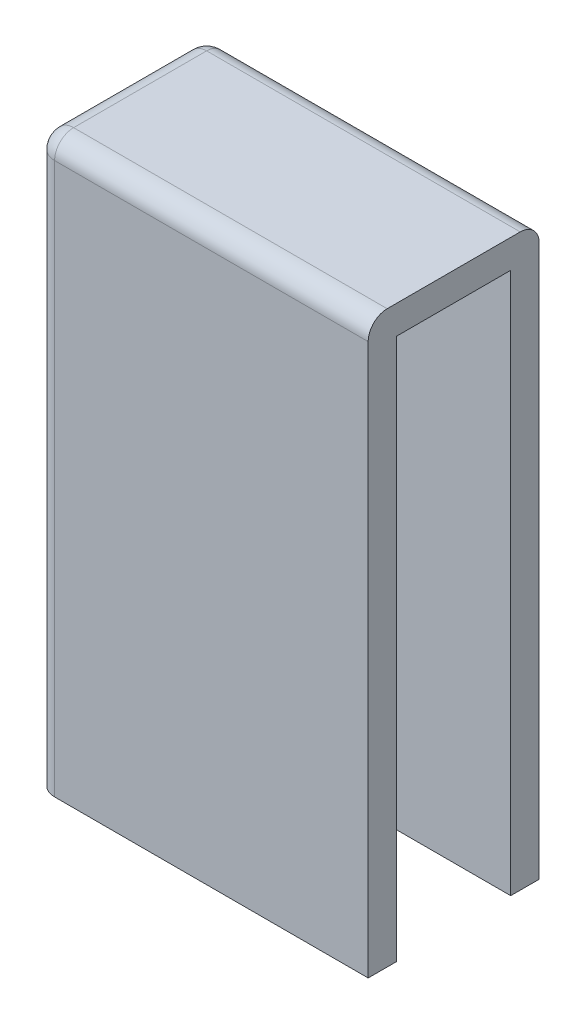
ISO-10303-21;
HEADER;
FILE_DESCRIPTION(('STEP AP214'),'2;1');
FILE_NAME('part.step','',(''),(''),'','','');
FILE_SCHEMA(('AUTOMOTIVE_DESIGN { 1 0 10303 214 1 1 1 1 }'));
ENDSEC;
DATA;
#1=APPLICATION_CONTEXT('core data for automotive mechanical design processes');
#2=APPLICATION_PROTOCOL_DEFINITION('international standard','automotive_design',2000,#1);
#3=PRODUCT_CONTEXT('',#1,'mechanical');
#4=PRODUCT('Part','Part','',(#3));
#5=PRODUCT_RELATED_PRODUCT_CATEGORY('part','',(#4));
#6=PRODUCT_DEFINITION_FORMATION('','',#4);
#7=PRODUCT_DEFINITION_CONTEXT('part definition',#1,'design');
#8=PRODUCT_DEFINITION('design','',#6,#7);
#9=PRODUCT_DEFINITION_SHAPE('','',#8);
#10=(LENGTH_UNIT() NAMED_UNIT(*) SI_UNIT(.MILLI.,.METRE.));
#11=(NAMED_UNIT(*) PLANE_ANGLE_UNIT() SI_UNIT($,.RADIAN.));
#12=(NAMED_UNIT(*) SI_UNIT($,.STERADIAN.) SOLID_ANGLE_UNIT());
#13=UNCERTAINTY_MEASURE_WITH_UNIT(LENGTH_MEASURE(1.E-05),#10,'distance_accuracy_value','');
#14=(GEOMETRIC_REPRESENTATION_CONTEXT(3) GLOBAL_UNCERTAINTY_ASSIGNED_CONTEXT((#13)) GLOBAL_UNIT_ASSIGNED_CONTEXT((#10,
#11,#12)) REPRESENTATION_CONTEXT('',''));
#15=CARTESIAN_POINT('',(0.,0.,0.));
#16=DIRECTION('',(0.,0.,1.));
#17=DIRECTION('',(1.,0.,0.));
#18=AXIS2_PLACEMENT_3D('',#15,#16,#17);
#19=CARTESIAN_POINT('',(0.,57.,0.));
#20=DIRECTION('',(0.,0.,1.));
#21=DIRECTION('',(1.,0.,0.));
#22=AXIS2_PLACEMENT_3D('',#19,#20,#21);
#23=PLANE('',#22);
#24=DIRECTION('',(-1.,0.,0.));
#25=VECTOR('',#24,1.);
#26=CARTESIAN_POINT('',(0.,0.,0.));
#27=LINE('',#26,#25);
#28=CARTESIAN_POINT('',(0.,0.,0.));
#29=VERTEX_POINT('',#28);
#30=CARTESIAN_POINT('',(-32.,0.,0.));
#31=VERTEX_POINT('',#30);
#32=EDGE_CURVE('E178',#29,#31,#27,.T.);
#33=ORIENTED_EDGE('',*,*,#32,.T.);
#34=DIRECTION('',(0.,-1.,0.));
#35=VECTOR('',#34,1.);
#36=CARTESIAN_POINT('',(-32.,57.,0.));
#37=LINE('',#36,#35);
#38=CARTESIAN_POINT('',(-32.,57.,0.));
#39=VERTEX_POINT('',#38);
#40=EDGE_CURVE('E206',#39,#31,#37,.T.);
#41=ORIENTED_EDGE('',*,*,#40,.F.);
#42=DIRECTION('',(-1.,0.,0.));
#43=VECTOR('',#42,1.);
#44=CARTESIAN_POINT('',(0.,57.,0.));
#45=LINE('',#44,#43);
#46=CARTESIAN_POINT('',(0.,57.,0.));
#47=VERTEX_POINT('',#46);
#48=EDGE_CURVE('E170',#47,#39,#45,.T.);
#49=ORIENTED_EDGE('',*,*,#48,.F.);
#50=DIRECTION('',(0.,-1.,0.));
#51=VECTOR('',#50,1.);
#52=CARTESIAN_POINT('',(0.,57.,0.));
#53=LINE('',#52,#51);
#54=EDGE_CURVE('E158',#47,#29,#53,.T.);
#55=ORIENTED_EDGE('',*,*,#54,.T.);
#56=EDGE_LOOP('',(#33,#41,#49,#55));
#57=FACE_BOUND('',#56,.T.);
#58=ADVANCED_FACE('F39',(#57),#23,.F.);
#59=CARTESIAN_POINT('',(-32.,57.,0.));
#60=DIRECTION('',(-1.,0.,0.));
#61=DIRECTION('',(0.,0.,1.));
#62=AXIS2_PLACEMENT_3D('',#59,#60,#61);
#63=PLANE('',#62);
#64=DIRECTION('',(0.,0.,-1.));
#65=VECTOR('',#64,1.);
#66=CARTESIAN_POINT('',(-32.,0.,0.));
#67=LINE('',#66,#65);
#68=CARTESIAN_POINT('',(-32.,0.,-12.));
#69=VERTEX_POINT('',#68);
#70=EDGE_CURVE('E181',#31,#69,#67,.T.);
#71=ORIENTED_EDGE('',*,*,#70,.T.);
#72=DIRECTION('',(0.,-1.,0.));
#73=VECTOR('',#72,1.);
#74=CARTESIAN_POINT('',(-32.,57.,-12.));
#75=LINE('',#74,#73);
#76=CARTESIAN_POINT('',(-32.,57.,-12.));
#77=VERTEX_POINT('',#76);
#78=EDGE_CURVE('E140',#77,#69,#75,.T.);
#79=ORIENTED_EDGE('',*,*,#78,.F.);
#80=DIRECTION('',(0.,0.,-1.));
#81=VECTOR('',#80,1.);
#82=CARTESIAN_POINT('',(-32.,57.,0.));
#83=LINE('',#82,#81);
#84=EDGE_CURVE('E149',#39,#77,#83,.T.);
#85=ORIENTED_EDGE('',*,*,#84,.F.);
#86=ORIENTED_EDGE('',*,*,#40,.T.);
#87=EDGE_LOOP('',(#71,#79,#85,#86));
#88=FACE_BOUND('',#87,.T.);
#89=ADVANCED_FACE('F312',(#88),#63,.F.);
#90=CARTESIAN_POINT('',(-32.,57.,-12.));
#91=DIRECTION('',(0.,0.,-1.));
#92=DIRECTION('',(-1.,0.,0.));
#93=AXIS2_PLACEMENT_3D('',#90,#91,#92);
#94=PLANE('',#93);
#95=DIRECTION('',(1.,0.,0.));
#96=VECTOR('',#95,1.);
#97=CARTESIAN_POINT('',(-32.,0.,-12.));
#98=LINE('',#97,#96);
#99=CARTESIAN_POINT('',(0.,0.,-12.));
#100=VERTEX_POINT('',#99);
#101=EDGE_CURVE('E134',#69,#100,#98,.T.);
#102=ORIENTED_EDGE('',*,*,#101,.T.);
#103=DIRECTION('',(0.,-1.,0.));
#104=VECTOR('',#103,1.);
#105=CARTESIAN_POINT('',(0.,57.,-12.));
#106=LINE('',#105,#104);
#107=CARTESIAN_POINT('',(0.,57.,-12.));
#108=VERTEX_POINT('',#107);
#109=EDGE_CURVE('E127',#108,#100,#106,.T.);
#110=ORIENTED_EDGE('',*,*,#109,.F.);
#111=DIRECTION('',(1.,0.,0.));
#112=VECTOR('',#111,1.);
#113=CARTESIAN_POINT('',(-32.,57.,-12.));
#114=LINE('',#113,#112);
#115=EDGE_CURVE('E131',#77,#108,#114,.T.);
#116=ORIENTED_EDGE('',*,*,#115,.F.);
#117=ORIENTED_EDGE('',*,*,#78,.T.);
#118=EDGE_LOOP('',(#102,#110,#116,#117));
#119=FACE_BOUND('',#118,.T.);
#120=ADVANCED_FACE('F129',(#119),#94,.F.);
#121=CARTESIAN_POINT('',(0.,57.,-12.));
#122=DIRECTION('',(-1.,0.,0.));
#123=DIRECTION('',(0.,0.,1.));
#124=AXIS2_PLACEMENT_3D('',#121,#122,#123);
#125=PLANE('',#124);
#126=DIRECTION('',(0.,-1.,0.));
#127=VECTOR('',#126,1.);
#128=CARTESIAN_POINT('',(0.,57.,-15.));
#129=LINE('',#128,#127);
#130=CARTESIAN_POINT('',(0.,58.,-15.));
#131=VERTEX_POINT('',#130);
#132=CARTESIAN_POINT('',(0.,0.,-15.));
#133=VERTEX_POINT('',#132);
#134=EDGE_CURVE('E141',#131,#133,#129,.T.);
#135=ORIENTED_EDGE('',*,*,#134,.F.);
#136=CARTESIAN_POINT('',(0.,58.,-13.));
#137=DIRECTION('',(-1.,0.,0.));
#138=DIRECTION('',(0.,0.,1.));
#139=AXIS2_PLACEMENT_3D('',#136,#137,#138);
#140=CIRCLE('',#139,2.);
#141=CARTESIAN_POINT('',(0.,60.,-13.));
#142=VERTEX_POINT('',#141);
#143=EDGE_CURVE('E231',#131,#142,#140,.F.);
#144=ORIENTED_EDGE('',*,*,#143,.T.);
#145=DIRECTION('',(0.,0.,-1.));
#146=VECTOR('',#145,1.);
#147=CARTESIAN_POINT('',(0.,60.,-15.));
#148=LINE('',#147,#146);
#149=CARTESIAN_POINT('',(0.,60.,1.));
#150=VERTEX_POINT('',#149);
#151=EDGE_CURVE('E160',#150,#142,#148,.T.);
#152=ORIENTED_EDGE('',*,*,#151,.F.);
#153=CARTESIAN_POINT('',(0.,58.,1.));
#154=DIRECTION('',(-1.,0.,0.));
#155=DIRECTION('',(0.,0.,1.));
#156=AXIS2_PLACEMENT_3D('',#153,#154,#155);
#157=CIRCLE('',#156,2.);
#158=CARTESIAN_POINT('',(0.,58.,3.));
#159=VERTEX_POINT('',#158);
#160=EDGE_CURVE('E228',#150,#159,#157,.F.);
#161=ORIENTED_EDGE('',*,*,#160,.T.);
#162=DIRECTION('',(0.,-1.,0.));
#163=VECTOR('',#162,1.);
#164=CARTESIAN_POINT('',(0.,57.,3.));
#165=LINE('',#164,#163);
#166=CARTESIAN_POINT('',(0.,0.,3.));
#167=VERTEX_POINT('',#166);
#168=EDGE_CURVE('E151',#159,#167,#165,.T.);
#169=ORIENTED_EDGE('',*,*,#168,.T.);
#170=DIRECTION('',(0.,0.,-1.));
#171=VECTOR('',#170,1.);
#172=CARTESIAN_POINT('',(0.,0.,0.));
#173=LINE('',#172,#171);
#174=EDGE_CURVE('E165',#167,#29,#173,.T.);
#175=ORIENTED_EDGE('',*,*,#174,.T.);
#176=ORIENTED_EDGE('',*,*,#54,.F.);
#177=DIRECTION('',(0.,0.,-1.));
#178=VECTOR('',#177,1.);
#179=CARTESIAN_POINT('',(0.,57.,-15.));
#180=LINE('',#179,#178);
#181=EDGE_CURVE('E147',#47,#108,#180,.T.);
#182=ORIENTED_EDGE('',*,*,#181,.T.);
#183=ORIENTED_EDGE('',*,*,#109,.T.);
#184=DIRECTION('',(0.,0.,-1.));
#185=VECTOR('',#184,1.);
#186=CARTESIAN_POINT('',(0.,0.,-12.));
#187=LINE('',#186,#185);
#188=EDGE_CURVE('E186',#100,#133,#187,.T.);
#189=ORIENTED_EDGE('',*,*,#188,.T.);
#190=EDGE_LOOP('',(#135,#144,#152,#161,#169,#175,#176,#182,#183,#189));
#191=FACE_BOUND('',#190,.T.);
#192=ADVANCED_FACE('F155',(#191),#125,.F.);
#193=CARTESIAN_POINT('',(-35.,57.,-15.));
#194=DIRECTION('',(0.,0.,1.));
#195=DIRECTION('',(1.,0.,0.));
#196=AXIS2_PLACEMENT_3D('',#193,#194,#195);
#197=PLANE('',#196);
#198=DIRECTION('',(0.,-1.,0.));
#199=VECTOR('',#198,1.);
#200=CARTESIAN_POINT('',(-33.,57.,-15.));
#201=LINE('',#200,#199);
#202=CARTESIAN_POINT('',(-33.,0.,-15.));
#203=VERTEX_POINT('',#202);
#204=CARTESIAN_POINT('',(-33.,58.,-15.));
#205=VERTEX_POINT('',#204);
#206=EDGE_CURVE('E222',#203,#205,#201,.F.);
#207=ORIENTED_EDGE('',*,*,#206,.T.);
#208=DIRECTION('',(-1.,0.,0.));
#209=VECTOR('',#208,1.);
#210=CARTESIAN_POINT('',(0.,58.,-15.));
#211=LINE('',#210,#209);
#212=EDGE_CURVE('E225',#205,#131,#211,.F.);
#213=ORIENTED_EDGE('',*,*,#212,.T.);
#214=ORIENTED_EDGE('',*,*,#134,.T.);
#215=DIRECTION('',(-1.,0.,0.));
#216=VECTOR('',#215,1.);
#217=CARTESIAN_POINT('',(-35.,0.,-15.));
#218=LINE('',#217,#216);
#219=EDGE_CURVE('E189',#133,#203,#218,.T.);
#220=ORIENTED_EDGE('',*,*,#219,.T.);
#221=EDGE_LOOP('',(#207,#213,#214,#220));
#222=FACE_BOUND('',#221,.T.);
#223=ADVANCED_FACE('F308',(#222),#197,.F.);
#224=CARTESIAN_POINT('',(-35.,57.,3.));
#225=DIRECTION('',(1.,0.,0.));
#226=DIRECTION('',(0.,0.,-1.));
#227=AXIS2_PLACEMENT_3D('',#224,#225,#226);
#228=PLANE('',#227);
#229=DIRECTION('',(0.,0.,1.));
#230=VECTOR('',#229,1.);
#231=CARTESIAN_POINT('',(-35.,58.,-15.));
#232=LINE('',#231,#230);
#233=CARTESIAN_POINT('',(-35.,58.,1.));
#234=VERTEX_POINT('',#233);
#235=CARTESIAN_POINT('',(-35.,58.,-13.));
#236=VERTEX_POINT('',#235);
#237=EDGE_CURVE('E234',#234,#236,#232,.F.);
#238=ORIENTED_EDGE('',*,*,#237,.T.);
#239=DIRECTION('',(0.,-1.,0.));
#240=VECTOR('',#239,1.);
#241=CARTESIAN_POINT('',(-35.,57.,-13.));
#242=LINE('',#241,#240);
#243=CARTESIAN_POINT('',(-35.,0.,-13.));
#244=VERTEX_POINT('',#243);
#245=EDGE_CURVE('E240',#236,#244,#242,.T.);
#246=ORIENTED_EDGE('',*,*,#245,.T.);
#247=DIRECTION('',(0.,0.,1.));
#248=VECTOR('',#247,1.);
#249=CARTESIAN_POINT('',(-35.,0.,3.));
#250=LINE('',#249,#248);
#251=CARTESIAN_POINT('',(-35.,0.,1.));
#252=VERTEX_POINT('',#251);
#253=EDGE_CURVE('E193',#244,#252,#250,.T.);
#254=ORIENTED_EDGE('',*,*,#253,.T.);
#255=DIRECTION('',(0.,-1.,0.));
#256=VECTOR('',#255,1.);
#257=CARTESIAN_POINT('',(-35.,57.,1.));
#258=LINE('',#257,#256);
#259=EDGE_CURVE('E237',#252,#234,#258,.F.);
#260=ORIENTED_EDGE('',*,*,#259,.T.);
#261=EDGE_LOOP('',(#238,#246,#254,#260));
#262=FACE_BOUND('',#261,.T.);
#263=ADVANCED_FACE('F298',(#262),#228,.F.);
#264=CARTESIAN_POINT('',(0.,57.,3.));
#265=DIRECTION('',(0.,0.,-1.));
#266=DIRECTION('',(-1.,0.,0.));
#267=AXIS2_PLACEMENT_3D('',#264,#265,#266);
#268=PLANE('',#267);
#269=DIRECTION('',(1.,0.,0.));
#270=VECTOR('',#269,1.);
#271=CARTESIAN_POINT('',(-35.,58.,3.));
#272=LINE('',#271,#270);
#273=CARTESIAN_POINT('',(-33.,58.,3.));
#274=VERTEX_POINT('',#273);
#275=EDGE_CURVE('E49',#159,#274,#272,.F.);
#276=ORIENTED_EDGE('',*,*,#275,.T.);
#277=DIRECTION('',(0.,-1.,0.));
#278=VECTOR('',#277,1.);
#279=CARTESIAN_POINT('',(-33.,57.,3.));
#280=LINE('',#279,#278);
#281=CARTESIAN_POINT('',(-33.,0.,3.));
#282=VERTEX_POINT('',#281);
#283=EDGE_CURVE('E11',#274,#282,#280,.T.);
#284=ORIENTED_EDGE('',*,*,#283,.T.);
#285=DIRECTION('',(1.,0.,0.));
#286=VECTOR('',#285,1.);
#287=CARTESIAN_POINT('',(0.,0.,3.));
#288=LINE('',#287,#286);
#289=EDGE_CURVE('E173',#282,#167,#288,.T.);
#290=ORIENTED_EDGE('',*,*,#289,.T.);
#291=ORIENTED_EDGE('',*,*,#168,.F.);
#292=EDGE_LOOP('',(#276,#284,#290,#291));
#293=FACE_BOUND('',#292,.T.);
#294=ADVANCED_FACE('F314',(#293),#268,.F.);
#295=CARTESIAN_POINT('',(0.,0.,0.));
#296=DIRECTION('',(0.,-1.,0.));
#297=DIRECTION('',(0.,0.,-1.));
#298=AXIS2_PLACEMENT_3D('',#295,#296,#297);
#299=PLANE('',#298);
#300=ORIENTED_EDGE('',*,*,#253,.F.);
#301=CARTESIAN_POINT('',(-33.,0.,-13.));
#302=DIRECTION('',(0.,-1.,0.));
#303=DIRECTION('',(0.,0.,-1.));
#304=AXIS2_PLACEMENT_3D('',#301,#302,#303);
#305=CIRCLE('',#304,2.);
#306=EDGE_CURVE('E246',#244,#203,#305,.T.);
#307=ORIENTED_EDGE('',*,*,#306,.T.);
#308=ORIENTED_EDGE('',*,*,#219,.F.);
#309=ORIENTED_EDGE('',*,*,#188,.F.);
#310=ORIENTED_EDGE('',*,*,#101,.F.);
#311=ORIENTED_EDGE('',*,*,#70,.F.);
#312=ORIENTED_EDGE('',*,*,#32,.F.);
#313=ORIENTED_EDGE('',*,*,#174,.F.);
#314=ORIENTED_EDGE('',*,*,#289,.F.);
#315=CARTESIAN_POINT('',(-33.,0.,1.));
#316=DIRECTION('',(0.,-1.,0.));
#317=DIRECTION('',(0.,0.,-1.));
#318=AXIS2_PLACEMENT_3D('',#315,#316,#317);
#319=CIRCLE('',#318,2.);
#320=EDGE_CURVE('E243',#282,#252,#319,.T.);
#321=ORIENTED_EDGE('',*,*,#320,.T.);
#322=EDGE_LOOP('',(#300,#307,#308,#309,#310,#311,#312,#313,#314,#321));
#323=FACE_BOUND('',#322,.T.);
#324=ADVANCED_FACE('F306',(#323),#299,.T.);
#325=CARTESIAN_POINT('',(0.,57.,0.));
#326=DIRECTION('',(0.,1.,0.));
#327=DIRECTION('',(0.,0.,1.));
#328=AXIS2_PLACEMENT_3D('',#325,#326,#327);
#329=PLANE('',#328);
#330=ORIENTED_EDGE('',*,*,#181,.F.);
#331=ORIENTED_EDGE('',*,*,#48,.T.);
#332=ORIENTED_EDGE('',*,*,#84,.T.);
#333=ORIENTED_EDGE('',*,*,#115,.T.);
#334=EDGE_LOOP('',(#330,#331,#332,#333));
#335=FACE_BOUND('',#334,.T.);
#336=ADVANCED_FACE('F145',(#335),#329,.F.);
#337=CARTESIAN_POINT('',(0.,60.,0.));
#338=DIRECTION('',(0.,1.,0.));
#339=DIRECTION('',(0.,0.,1.));
#340=AXIS2_PLACEMENT_3D('',#337,#338,#339);
#341=PLANE('',#340);
#342=ORIENTED_EDGE('',*,*,#151,.T.);
#343=DIRECTION('',(-1.,0.,0.));
#344=VECTOR('',#343,1.);
#345=CARTESIAN_POINT('',(-35.,60.,-13.));
#346=LINE('',#345,#344);
#347=CARTESIAN_POINT('',(-33.,60.,-13.));
#348=VERTEX_POINT('',#347);
#349=EDGE_CURVE('E218',#142,#348,#346,.T.);
#350=ORIENTED_EDGE('',*,*,#349,.T.);
#351=DIRECTION('',(0.,0.,1.));
#352=VECTOR('',#351,1.);
#353=CARTESIAN_POINT('',(-33.,60.,3.));
#354=LINE('',#353,#352);
#355=CARTESIAN_POINT('',(-33.,60.,1.));
#356=VERTEX_POINT('',#355);
#357=EDGE_CURVE('E215',#348,#356,#354,.T.);
#358=ORIENTED_EDGE('',*,*,#357,.T.);
#359=DIRECTION('',(1.,0.,0.));
#360=VECTOR('',#359,1.);
#361=CARTESIAN_POINT('',(0.,60.,1.));
#362=LINE('',#361,#360);
#363=EDGE_CURVE('E212',#356,#150,#362,.T.);
#364=ORIENTED_EDGE('',*,*,#363,.T.);
#365=EDGE_LOOP('',(#342,#350,#358,#364));
#366=FACE_BOUND('',#365,.T.);
#367=ADVANCED_FACE('F282',(#366),#341,.T.);
#368=CARTESIAN_POINT('',(0.,58.,1.));
#369=DIRECTION('',(-1.,0.,0.));
#370=DIRECTION('',(0.,0.,1.));
#371=AXIS2_PLACEMENT_3D('',#368,#369,#370);
#372=CYLINDRICAL_SURFACE('',#371,2.);
#373=ORIENTED_EDGE('',*,*,#160,.F.);
#374=ORIENTED_EDGE('',*,*,#363,.F.);
#375=CARTESIAN_POINT('',(-33.,58.,1.));
#376=DIRECTION('',(-1.,0.,0.));
#377=DIRECTION('',(0.,-1.,0.));
#378=AXIS2_PLACEMENT_3D('',#375,#376,#377);
#379=CIRCLE('',#378,2.);
#380=EDGE_CURVE('E43',#274,#356,#379,.T.);
#381=ORIENTED_EDGE('',*,*,#380,.F.);
#382=ORIENTED_EDGE('',*,*,#275,.F.);
#383=EDGE_LOOP('',(#373,#374,#381,#382));
#384=FACE_BOUND('',#383,.T.);
#385=ADVANCED_FACE('F41',(#384),#372,.T.);
#386=CARTESIAN_POINT('',(-33.,57.,1.));
#387=DIRECTION('',(0.,-1.,0.));
#388=DIRECTION('',(0.,0.,-1.));
#389=AXIS2_PLACEMENT_3D('',#386,#387,#388);
#390=CYLINDRICAL_SURFACE('',#389,2.);
#391=ORIENTED_EDGE('',*,*,#320,.F.);
#392=ORIENTED_EDGE('',*,*,#283,.F.);
#393=CARTESIAN_POINT('',(-33.,58.,1.));
#394=DIRECTION('',(0.,1.,0.));
#395=DIRECTION('',(0.,0.,1.));
#396=AXIS2_PLACEMENT_3D('',#393,#394,#395);
#397=CIRCLE('',#396,2.);
#398=EDGE_CURVE('E168',#234,#274,#397,.T.);
#399=ORIENTED_EDGE('',*,*,#398,.F.);
#400=ORIENTED_EDGE('',*,*,#259,.F.);
#401=EDGE_LOOP('',(#391,#392,#399,#400));
#402=FACE_BOUND('',#401,.T.);
#403=ADVANCED_FACE('F276',(#402),#390,.T.);
#404=CARTESIAN_POINT('',(-33.,58.,1.));
#405=DIRECTION('',(0.,0.,1.));
#406=DIRECTION('',(1.,0.,0.));
#407=AXIS2_PLACEMENT_3D('',#404,#405,#406);
#408=SPHERICAL_SURFACE('',#407,2.);
#409=ORIENTED_EDGE('',*,*,#398,.T.);
#410=ORIENTED_EDGE('',*,*,#380,.T.);
#411=CARTESIAN_POINT('',(-33.,58.,1.));
#412=DIRECTION('',(0.,0.,1.));
#413=DIRECTION('',(1.,0.,0.));
#414=AXIS2_PLACEMENT_3D('',#411,#412,#413);
#415=CIRCLE('',#414,2.);
#416=EDGE_CURVE('E262',#234,#356,#415,.F.);
#417=ORIENTED_EDGE('',*,*,#416,.F.);
#418=EDGE_LOOP('',(#409,#410,#417));
#419=FACE_BOUND('',#418,.T.);
#420=ADVANCED_FACE('F270',(#419),#408,.T.);
#421=CARTESIAN_POINT('',(-33.,58.,0.));
#422=DIRECTION('',(0.,0.,-1.));
#423=DIRECTION('',(-1.,0.,0.));
#424=AXIS2_PLACEMENT_3D('',#421,#422,#423);
#425=CYLINDRICAL_SURFACE('',#424,2.);
#426=ORIENTED_EDGE('',*,*,#416,.T.);
#427=ORIENTED_EDGE('',*,*,#357,.F.);
#428=CARTESIAN_POINT('',(-33.,58.,-13.));
#429=DIRECTION('',(0.,0.,-1.));
#430=DIRECTION('',(0.,1.,0.));
#431=AXIS2_PLACEMENT_3D('',#428,#429,#430);
#432=CIRCLE('',#431,2.);
#433=EDGE_CURVE('E258',#236,#348,#432,.T.);
#434=ORIENTED_EDGE('',*,*,#433,.F.);
#435=ORIENTED_EDGE('',*,*,#237,.F.);
#436=EDGE_LOOP('',(#426,#427,#434,#435));
#437=FACE_BOUND('',#436,.T.);
#438=ADVANCED_FACE('F295',(#437),#425,.T.);
#439=CARTESIAN_POINT('',(-33.,57.,-13.));
#440=DIRECTION('',(0.,-1.,0.));
#441=DIRECTION('',(0.,0.,-1.));
#442=AXIS2_PLACEMENT_3D('',#439,#440,#441);
#443=CYLINDRICAL_SURFACE('',#442,2.);
#444=ORIENTED_EDGE('',*,*,#306,.F.);
#445=ORIENTED_EDGE('',*,*,#245,.F.);
#446=CARTESIAN_POINT('',(-33.,58.,-13.));
#447=DIRECTION('',(0.,1.,0.));
#448=DIRECTION('',(0.,0.,1.));
#449=AXIS2_PLACEMENT_3D('',#446,#447,#448);
#450=CIRCLE('',#449,2.);
#451=EDGE_CURVE('E254',#205,#236,#450,.T.);
#452=ORIENTED_EDGE('',*,*,#451,.F.);
#453=ORIENTED_EDGE('',*,*,#206,.F.);
#454=EDGE_LOOP('',(#444,#445,#452,#453));
#455=FACE_BOUND('',#454,.T.);
#456=ADVANCED_FACE('F302',(#455),#443,.T.);
#457=CARTESIAN_POINT('',(-33.,58.,-13.));
#458=DIRECTION('',(0.,0.,1.));
#459=DIRECTION('',(1.,0.,0.));
#460=AXIS2_PLACEMENT_3D('',#457,#458,#459);
#461=SPHERICAL_SURFACE('',#460,2.);
#462=ORIENTED_EDGE('',*,*,#451,.T.);
#463=ORIENTED_EDGE('',*,*,#433,.T.);
#464=CARTESIAN_POINT('',(-33.,58.,-13.));
#465=DIRECTION('',(-1.,0.,0.));
#466=DIRECTION('',(0.,0.,1.));
#467=AXIS2_PLACEMENT_3D('',#464,#465,#466);
#468=CIRCLE('',#467,2.);
#469=EDGE_CURVE('E251',#205,#348,#468,.F.);
#470=ORIENTED_EDGE('',*,*,#469,.F.);
#471=EDGE_LOOP('',(#462,#463,#470));
#472=FACE_BOUND('',#471,.T.);
#473=ADVANCED_FACE('F292',(#472),#461,.T.);
#474=CARTESIAN_POINT('',(0.,58.,-13.));
#475=DIRECTION('',(1.,0.,0.));
#476=DIRECTION('',(0.,0.,-1.));
#477=AXIS2_PLACEMENT_3D('',#474,#475,#476);
#478=CYLINDRICAL_SURFACE('',#477,2.);
#479=ORIENTED_EDGE('',*,*,#143,.F.);
#480=ORIENTED_EDGE('',*,*,#212,.F.);
#481=ORIENTED_EDGE('',*,*,#469,.T.);
#482=ORIENTED_EDGE('',*,*,#349,.F.);
#483=EDGE_LOOP('',(#479,#480,#481,#482));
#484=FACE_BOUND('',#483,.T.);
#485=ADVANCED_FACE('F288',(#484),#478,.T.);
#486=CLOSED_SHELL('',(#58,#89,#120,#192,#223,#263,#294,#324,#336,#367,#385,#403,#420,#438,#456,
#473,#485));
#487=MANIFOLD_SOLID_BREP('B2',#486);
#488=ADVANCED_BREP_SHAPE_REPRESENTATION('',(#18,#487),#14);
#489=SHAPE_DEFINITION_REPRESENTATION(#9,#488);
ENDSEC;
END-ISO-10303-21;
